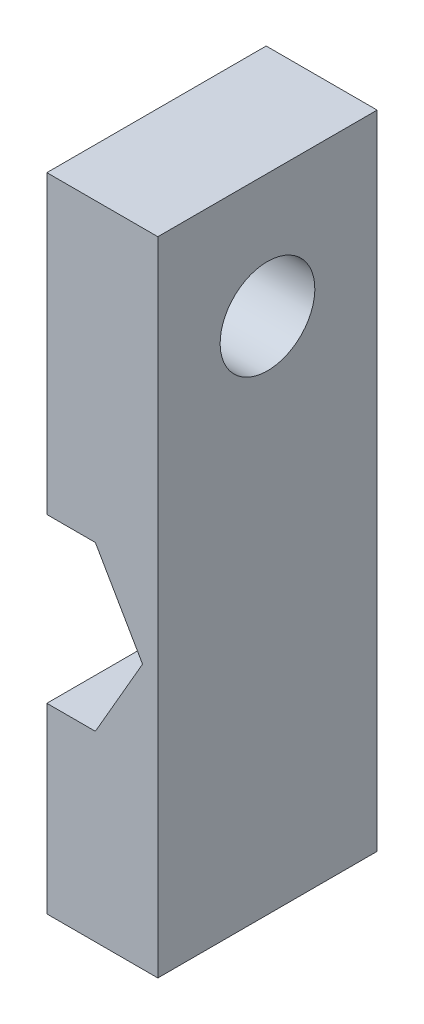
ISO-10303-21;
HEADER;
FILE_DESCRIPTION(('STEP AP214'),'2;1');
FILE_NAME('part.step','',(''),(''),'','','');
FILE_SCHEMA(('AUTOMOTIVE_DESIGN { 1 0 10303 214 1 1 1 1 }'));
ENDSEC;
DATA;
#1=APPLICATION_CONTEXT('core data for automotive mechanical design processes');
#2=APPLICATION_PROTOCOL_DEFINITION('international standard','automotive_design',2000,#1);
#3=PRODUCT_CONTEXT('',#1,'mechanical');
#4=PRODUCT('Part','Part','',(#3));
#5=PRODUCT_RELATED_PRODUCT_CATEGORY('part','',(#4));
#6=PRODUCT_DEFINITION_FORMATION('','',#4);
#7=PRODUCT_DEFINITION_CONTEXT('part definition',#1,'design');
#8=PRODUCT_DEFINITION('design','',#6,#7);
#9=PRODUCT_DEFINITION_SHAPE('','',#8);
#10=(LENGTH_UNIT() NAMED_UNIT(*) SI_UNIT(.MILLI.,.METRE.));
#11=(NAMED_UNIT(*) PLANE_ANGLE_UNIT() SI_UNIT($,.RADIAN.));
#12=(NAMED_UNIT(*) SI_UNIT($,.STERADIAN.) SOLID_ANGLE_UNIT());
#13=UNCERTAINTY_MEASURE_WITH_UNIT(LENGTH_MEASURE(1.E-05),#10,'distance_accuracy_value','');
#14=(GEOMETRIC_REPRESENTATION_CONTEXT(3) GLOBAL_UNCERTAINTY_ASSIGNED_CONTEXT((#13)) GLOBAL_UNIT_ASSIGNED_CONTEXT((#10,
#11,#12)) REPRESENTATION_CONTEXT('',''));
#15=CARTESIAN_POINT('',(0.,0.,0.));
#16=DIRECTION('',(0.,0.,1.));
#17=DIRECTION('',(1.,0.,0.));
#18=AXIS2_PLACEMENT_3D('',#15,#16,#17);
#19=CARTESIAN_POINT('',(0.,0.,22.));
#20=DIRECTION('',(0.,0.,1.));
#21=DIRECTION('',(1.,0.,0.));
#22=AXIS2_PLACEMENT_3D('',#19,#20,#21);
#23=PLANE('',#22);
#24=DIRECTION('',(-1.,0.,0.));
#25=VECTOR('',#24,1.);
#26=CARTESIAN_POINT('',(-10.8674698795181,4.62068534094692,22.));
#27=LINE('',#26,#25);
#28=CARTESIAN_POINT('',(11.1325301204819,4.62068534094692,22.));
#29=VERTEX_POINT('',#28);
#30=CARTESIAN_POINT('',(0.,4.62068534094692,22.));
#31=VERTEX_POINT('',#30);
#32=EDGE_CURVE('E148',#29,#31,#27,.T.);
#33=ORIENTED_EDGE('',*,*,#32,.T.);
#34=DIRECTION('',(0.,-1.,0.));
#35=VECTOR('',#34,1.);
#36=CARTESIAN_POINT('',(0.,4.62068534094692,22.));
#37=LINE('',#36,#35);
#38=CARTESIAN_POINT('',(0.,-25.0793146590531,22.));
#39=VERTEX_POINT('',#38);
#40=EDGE_CURVE('E113',#31,#39,#37,.T.);
#41=ORIENTED_EDGE('',*,*,#40,.T.);
#42=DIRECTION('',(-1.,0.,0.));
#43=VECTOR('',#42,1.);
#44=CARTESIAN_POINT('',(4.86680232783685,-25.0793146590531,22.));
#45=LINE('',#44,#43);
#46=CARTESIAN_POINT('',(4.86680232783685,-25.0793146590531,22.));
#47=VERTEX_POINT('',#46);
#48=EDGE_CURVE('E191',#47,#39,#45,.T.);
#49=ORIENTED_EDGE('',*,*,#48,.F.);
#50=DIRECTION('',(-0.5,0.866025403784438,0.));
#51=VECTOR('',#50,1.);
#52=CARTESIAN_POINT('',(9.60107453519178,-33.2793146590531,22.));
#53=LINE('',#52,#51);
#54=CARTESIAN_POINT('',(9.60107453519178,-33.2793146590531,22.));
#55=VERTEX_POINT('',#54);
#56=EDGE_CURVE('E195',#55,#47,#53,.T.);
#57=ORIENTED_EDGE('',*,*,#56,.F.);
#58=DIRECTION('',(0.499999999999999,0.866025403784439,0.));
#59=VECTOR('',#58,1.);
#60=CARTESIAN_POINT('',(4.86680232783685,-41.4793146590531,22.));
#61=LINE('',#60,#59);
#62=CARTESIAN_POINT('',(4.86680232783685,-41.4793146590531,22.));
#63=VERTEX_POINT('',#62);
#64=EDGE_CURVE('E179',#63,#55,#61,.T.);
#65=ORIENTED_EDGE('',*,*,#64,.F.);
#66=DIRECTION('',(1.,0.,0.));
#67=VECTOR('',#66,1.);
#68=CARTESIAN_POINT('',(-4.60174208687301,-41.4793146590531,22.));
#69=LINE('',#68,#67);
#70=CARTESIAN_POINT('',(0.,-41.4793146590531,22.));
#71=VERTEX_POINT('',#70);
#72=EDGE_CURVE('E175',#71,#63,#69,.T.);
#73=ORIENTED_EDGE('',*,*,#72,.F.);
#74=CARTESIAN_POINT('',(0.,-59.7793146590531,22.));
#75=VERTEX_POINT('',#74);
#76=EDGE_CURVE('E64',#71,#75,#37,.T.);
#77=ORIENTED_EDGE('',*,*,#76,.T.);
#78=DIRECTION('',(1.,0.,0.));
#79=VECTOR('',#78,1.);
#80=CARTESIAN_POINT('',(-10.8674698795181,-59.7793146590531,22.));
#81=LINE('',#80,#79);
#82=CARTESIAN_POINT('',(11.1325301204819,-59.7793146590531,22.));
#83=VERTEX_POINT('',#82);
#84=EDGE_CURVE('E136',#75,#83,#81,.T.);
#85=ORIENTED_EDGE('',*,*,#84,.T.);
#86=DIRECTION('',(0.,1.,0.));
#87=VECTOR('',#86,1.);
#88=CARTESIAN_POINT('',(11.1325301204819,4.62068534094692,22.));
#89=LINE('',#88,#87);
#90=EDGE_CURVE('E141',#83,#29,#89,.T.);
#91=ORIENTED_EDGE('',*,*,#90,.T.);
#92=EDGE_LOOP('',(#33,#41,#49,#57,#65,#73,#77,#85,#91));
#93=FACE_BOUND('',#92,.T.);
#94=ADVANCED_FACE('F39',(#93),#23,.T.);
#95=CARTESIAN_POINT('',(0.,0.,0.));
#96=DIRECTION('',(0.,0.,1.));
#97=DIRECTION('',(1.,0.,0.));
#98=AXIS2_PLACEMENT_3D('',#95,#96,#97);
#99=PLANE('',#98);
#100=DIRECTION('',(0.,1.,0.));
#101=VECTOR('',#100,1.);
#102=CARTESIAN_POINT('',(0.,4.62068534094692,0.));
#103=LINE('',#102,#101);
#104=CARTESIAN_POINT('',(0.,-25.0793146590531,0.));
#105=VERTEX_POINT('',#104);
#106=CARTESIAN_POINT('',(0.,4.62068534094692,0.));
#107=VERTEX_POINT('',#106);
#108=EDGE_CURVE('E56',#105,#107,#103,.T.);
#109=ORIENTED_EDGE('',*,*,#108,.T.);
#110=DIRECTION('',(-1.,0.,0.));
#111=VECTOR('',#110,1.);
#112=CARTESIAN_POINT('',(-10.8674698795181,4.62068534094692,0.));
#113=LINE('',#112,#111);
#114=CARTESIAN_POINT('',(11.1325301204819,4.62068534094692,0.));
#115=VERTEX_POINT('',#114);
#116=EDGE_CURVE('E126',#115,#107,#113,.T.);
#117=ORIENTED_EDGE('',*,*,#116,.F.);
#118=DIRECTION('',(0.,1.,0.));
#119=VECTOR('',#118,1.);
#120=CARTESIAN_POINT('',(11.1325301204819,4.62068534094692,0.));
#121=LINE('',#120,#119);
#122=CARTESIAN_POINT('',(11.1325301204819,-59.7793146590531,0.));
#123=VERTEX_POINT('',#122);
#124=EDGE_CURVE('E137',#123,#115,#121,.T.);
#125=ORIENTED_EDGE('',*,*,#124,.F.);
#126=DIRECTION('',(1.,0.,0.));
#127=VECTOR('',#126,1.);
#128=CARTESIAN_POINT('',(-10.8674698795181,-59.7793146590531,0.));
#129=LINE('',#128,#127);
#130=CARTESIAN_POINT('',(0.,-59.7793146590531,0.));
#131=VERTEX_POINT('',#130);
#132=EDGE_CURVE('E143',#131,#123,#129,.T.);
#133=ORIENTED_EDGE('',*,*,#132,.F.);
#134=CARTESIAN_POINT('',(0.,-41.4793146590531,0.));
#135=VERTEX_POINT('',#134);
#136=EDGE_CURVE('E119',#131,#135,#103,.T.);
#137=ORIENTED_EDGE('',*,*,#136,.T.);
#138=DIRECTION('',(1.,0.,0.));
#139=VECTOR('',#138,1.);
#140=CARTESIAN_POINT('',(-4.60174208687301,-41.4793146590531,0.));
#141=LINE('',#140,#139);
#142=CARTESIAN_POINT('',(4.86680232783685,-41.4793146590531,0.));
#143=VERTEX_POINT('',#142);
#144=EDGE_CURVE('E176',#135,#143,#141,.T.);
#145=ORIENTED_EDGE('',*,*,#144,.T.);
#146=DIRECTION('',(0.499999999999999,0.866025403784439,0.));
#147=VECTOR('',#146,1.);
#148=CARTESIAN_POINT('',(4.86680232783685,-41.4793146590531,0.));
#149=LINE('',#148,#147);
#150=CARTESIAN_POINT('',(9.60107453519178,-33.2793146590531,0.));
#151=VERTEX_POINT('',#150);
#152=EDGE_CURVE('E185',#143,#151,#149,.T.);
#153=ORIENTED_EDGE('',*,*,#152,.T.);
#154=DIRECTION('',(-0.5,0.866025403784438,0.));
#155=VECTOR('',#154,1.);
#156=CARTESIAN_POINT('',(9.60107453519178,-33.2793146590531,0.));
#157=LINE('',#156,#155);
#158=CARTESIAN_POINT('',(4.86680232783685,-25.0793146590531,0.));
#159=VERTEX_POINT('',#158);
#160=EDGE_CURVE('E182',#151,#159,#157,.T.);
#161=ORIENTED_EDGE('',*,*,#160,.T.);
#162=DIRECTION('',(-1.,0.,0.));
#163=VECTOR('',#162,1.);
#164=CARTESIAN_POINT('',(4.86680232783685,-25.0793146590531,0.));
#165=LINE('',#164,#163);
#166=EDGE_CURVE('E129',#159,#105,#165,.T.);
#167=ORIENTED_EDGE('',*,*,#166,.T.);
#168=EDGE_LOOP('',(#109,#117,#125,#133,#137,#145,#153,#161,#167));
#169=FACE_BOUND('',#168,.T.);
#170=ADVANCED_FACE('F124',(#169),#99,.F.);
#171=CARTESIAN_POINT('',(-10.8674698795181,-59.7793146590531,22.));
#172=DIRECTION('',(0.,1.,0.));
#173=DIRECTION('',(0.,0.,1.));
#174=AXIS2_PLACEMENT_3D('',#171,#172,#173);
#175=PLANE('',#174);
#176=DIRECTION('',(0.,0.,-1.));
#177=VECTOR('',#176,1.);
#178=CARTESIAN_POINT('',(0.,-59.7793146590531,0.));
#179=LINE('',#178,#177);
#180=EDGE_CURVE('E209',#75,#131,#179,.T.);
#181=ORIENTED_EDGE('',*,*,#180,.T.);
#182=ORIENTED_EDGE('',*,*,#132,.T.);
#183=DIRECTION('',(0.,0.,-1.));
#184=VECTOR('',#183,1.);
#185=CARTESIAN_POINT('',(11.1325301204819,-59.7793146590531,22.));
#186=LINE('',#185,#184);
#187=EDGE_CURVE('E11',#83,#123,#186,.T.);
#188=ORIENTED_EDGE('',*,*,#187,.F.);
#189=ORIENTED_EDGE('',*,*,#84,.F.);
#190=EDGE_LOOP('',(#181,#182,#188,#189));
#191=FACE_BOUND('',#190,.T.);
#192=ADVANCED_FACE('F41',(#191),#175,.F.);
#193=CARTESIAN_POINT('',(-10.8674698795181,4.62068534094692,22.));
#194=DIRECTION('',(0.,-1.,0.));
#195=DIRECTION('',(1.,0.,0.));
#196=AXIS2_PLACEMENT_3D('',#193,#194,#195);
#197=PLANE('',#196);
#198=DIRECTION('',(0.,0.,1.));
#199=VECTOR('',#198,1.);
#200=CARTESIAN_POINT('',(0.,4.62068534094692,0.));
#201=LINE('',#200,#199);
#202=EDGE_CURVE('E110',#107,#31,#201,.T.);
#203=ORIENTED_EDGE('',*,*,#202,.T.);
#204=ORIENTED_EDGE('',*,*,#32,.F.);
#205=DIRECTION('',(0.,0.,-1.));
#206=VECTOR('',#205,1.);
#207=CARTESIAN_POINT('',(11.1325301204819,4.62068534094692,22.));
#208=LINE('',#207,#206);
#209=EDGE_CURVE('E49',#29,#115,#208,.T.);
#210=ORIENTED_EDGE('',*,*,#209,.T.);
#211=ORIENTED_EDGE('',*,*,#116,.T.);
#212=EDGE_LOOP('',(#203,#204,#210,#211));
#213=FACE_BOUND('',#212,.T.);
#214=ADVANCED_FACE('F133',(#213),#197,.F.);
#215=CARTESIAN_POINT('',(4.86680232783685,-25.0793146590531,22.));
#216=DIRECTION('',(0.,-1.,0.));
#217=DIRECTION('',(1.,0.,0.));
#218=AXIS2_PLACEMENT_3D('',#215,#216,#217);
#219=PLANE('',#218);
#220=ORIENTED_EDGE('',*,*,#48,.T.);
#221=DIRECTION('',(0.,0.,-1.));
#222=VECTOR('',#221,1.);
#223=CARTESIAN_POINT('',(0.,-25.0793146590531,22.));
#224=LINE('',#223,#222);
#225=EDGE_CURVE('E203',#39,#105,#224,.T.);
#226=ORIENTED_EDGE('',*,*,#225,.T.);
#227=ORIENTED_EDGE('',*,*,#166,.F.);
#228=DIRECTION('',(0.,0.,-1.));
#229=VECTOR('',#228,1.);
#230=CARTESIAN_POINT('',(4.86680232783685,-25.0793146590531,22.));
#231=LINE('',#230,#229);
#232=EDGE_CURVE('E162',#47,#159,#231,.T.);
#233=ORIENTED_EDGE('',*,*,#232,.F.);
#234=EDGE_LOOP('',(#220,#226,#227,#233));
#235=FACE_BOUND('',#234,.T.);
#236=ADVANCED_FACE('F228',(#235),#219,.T.);
#237=CARTESIAN_POINT('',(-4.60174208687301,-41.4793146590531,22.));
#238=DIRECTION('',(0.,1.,0.));
#239=DIRECTION('',(0.,0.,1.));
#240=AXIS2_PLACEMENT_3D('',#237,#238,#239);
#241=PLANE('',#240);
#242=ORIENTED_EDGE('',*,*,#144,.F.);
#243=DIRECTION('',(0.,0.,1.));
#244=VECTOR('',#243,1.);
#245=CARTESIAN_POINT('',(0.,-41.4793146590531,22.));
#246=LINE('',#245,#244);
#247=EDGE_CURVE('E206',#135,#71,#246,.T.);
#248=ORIENTED_EDGE('',*,*,#247,.T.);
#249=ORIENTED_EDGE('',*,*,#72,.T.);
#250=DIRECTION('',(0.,0.,-1.));
#251=VECTOR('',#250,1.);
#252=CARTESIAN_POINT('',(4.86680232783685,-41.4793146590531,22.));
#253=LINE('',#252,#251);
#254=EDGE_CURVE('E169',#63,#143,#253,.T.);
#255=ORIENTED_EDGE('',*,*,#254,.T.);
#256=EDGE_LOOP('',(#242,#248,#249,#255));
#257=FACE_BOUND('',#256,.T.);
#258=ADVANCED_FACE('F217',(#257),#241,.T.);
#259=CARTESIAN_POINT('',(-10.8674698795181,-7.77931465905308,11.));
#260=DIRECTION('',(1.,0.,0.));
#261=DIRECTION('',(0.,1.,0.));
#262=AXIS2_PLACEMENT_3D('',#259,#260,#261);
#263=CYLINDRICAL_SURFACE('',#262,4.75);
#264=CARTESIAN_POINT('',(11.1325301204819,-7.77931465905308,11.));
#265=DIRECTION('',(1.,0.,0.));
#266=DIRECTION('',(0.,1.,0.));
#267=AXIS2_PLACEMENT_3D('',#264,#265,#266);
#268=CIRCLE('',#267,4.75);
#269=CARTESIAN_POINT('',(11.1325301204819,-3.02931465905308,11.));
#270=VERTEX_POINT('',#269);
#271=EDGE_CURVE('E188',#270,#270,#268,.T.);
#272=ORIENTED_EDGE('',*,*,#271,.T.);
#273=EDGE_LOOP('',(#272));
#274=FACE_BOUND('',#273,.T.);
#275=CARTESIAN_POINT('',(0.,-7.77931465905308,11.));
#276=DIRECTION('',(-1.,0.,0.));
#277=DIRECTION('',(0.,0.,1.));
#278=AXIS2_PLACEMENT_3D('',#275,#276,#277);
#279=CIRCLE('',#278,4.75);
#280=CARTESIAN_POINT('',(0.,-7.77931465905308,15.75));
#281=VERTEX_POINT('',#280);
#282=EDGE_CURVE('E43',#281,#281,#279,.F.);
#283=ORIENTED_EDGE('',*,*,#282,.F.);
#284=EDGE_LOOP('',(#283));
#285=FACE_BOUND('',#284,.T.);
#286=ADVANCED_FACE('F235',(#274,#285),#263,.F.);
#287=CARTESIAN_POINT('',(11.1325301204819,4.62068534094692,22.));
#288=DIRECTION('',(-1.,0.,0.));
#289=DIRECTION('',(0.,-1.,0.));
#290=AXIS2_PLACEMENT_3D('',#287,#288,#289);
#291=PLANE('',#290);
#292=ORIENTED_EDGE('',*,*,#271,.F.);
#293=EDGE_LOOP('',(#292));
#294=FACE_BOUND('',#293,.T.);
#295=ORIENTED_EDGE('',*,*,#124,.T.);
#296=ORIENTED_EDGE('',*,*,#209,.F.);
#297=ORIENTED_EDGE('',*,*,#90,.F.);
#298=ORIENTED_EDGE('',*,*,#187,.T.);
#299=EDGE_LOOP('',(#295,#296,#297,#298));
#300=FACE_BOUND('',#299,.T.);
#301=ADVANCED_FACE('F246',(#294,#300),#291,.F.);
#302=CARTESIAN_POINT('',(4.86680232783685,-41.4793146590531,22.));
#303=DIRECTION('',(-0.866025403784439,0.5,0.));
#304=DIRECTION('',(-0.5,-0.866025403784439,0.));
#305=AXIS2_PLACEMENT_3D('',#302,#303,#304);
#306=PLANE('',#305);
#307=ORIENTED_EDGE('',*,*,#152,.F.);
#308=ORIENTED_EDGE('',*,*,#254,.F.);
#309=ORIENTED_EDGE('',*,*,#64,.T.);
#310=DIRECTION('',(0.,0.,-1.));
#311=VECTOR('',#310,1.);
#312=CARTESIAN_POINT('',(9.60107453519178,-33.2793146590531,22.));
#313=LINE('',#312,#311);
#314=EDGE_CURVE('E155',#55,#151,#313,.T.);
#315=ORIENTED_EDGE('',*,*,#314,.T.);
#316=EDGE_LOOP('',(#307,#308,#309,#315));
#317=FACE_BOUND('',#316,.T.);
#318=ADVANCED_FACE('F221',(#317),#306,.T.);
#319=CARTESIAN_POINT('',(9.60107453519178,-33.2793146590531,22.));
#320=DIRECTION('',(-0.866025403784439,-0.5,0.));
#321=DIRECTION('',(0.5,-0.866025403784439,0.));
#322=AXIS2_PLACEMENT_3D('',#319,#320,#321);
#323=PLANE('',#322);
#324=ORIENTED_EDGE('',*,*,#160,.F.);
#325=ORIENTED_EDGE('',*,*,#314,.F.);
#326=ORIENTED_EDGE('',*,*,#56,.T.);
#327=ORIENTED_EDGE('',*,*,#232,.T.);
#328=EDGE_LOOP('',(#324,#325,#326,#327));
#329=FACE_BOUND('',#328,.T.);
#330=ADVANCED_FACE('F226',(#329),#323,.T.);
#331=CARTESIAN_POINT('',(0.,0.,0.));
#332=DIRECTION('',(-1.,0.,0.));
#333=DIRECTION('',(0.,0.,1.));
#334=AXIS2_PLACEMENT_3D('',#331,#332,#333);
#335=PLANE('',#334);
#336=ORIENTED_EDGE('',*,*,#282,.T.);
#337=EDGE_LOOP('',(#336));
#338=FACE_BOUND('',#337,.T.);
#339=ORIENTED_EDGE('',*,*,#40,.F.);
#340=ORIENTED_EDGE('',*,*,#202,.F.);
#341=ORIENTED_EDGE('',*,*,#108,.F.);
#342=ORIENTED_EDGE('',*,*,#225,.F.);
#343=EDGE_LOOP('',(#339,#340,#341,#342));
#344=FACE_BOUND('',#343,.T.);
#345=ADVANCED_FACE('F111',(#338,#344),#335,.T.);
#346=ORIENTED_EDGE('',*,*,#136,.F.);
#347=ORIENTED_EDGE('',*,*,#180,.F.);
#348=ORIENTED_EDGE('',*,*,#76,.F.);
#349=ORIENTED_EDGE('',*,*,#247,.F.);
#350=EDGE_LOOP('',(#346,#347,#348,#349));
#351=FACE_BOUND('',#350,.T.);
#352=ADVANCED_FACE('F266',(#351),#335,.T.);
#353=CLOSED_SHELL('',(#94,#170,#192,#214,#236,#258,#286,#301,#318,#330,#345,#352));
#354=MANIFOLD_SOLID_BREP('B2',#353);
#355=ADVANCED_BREP_SHAPE_REPRESENTATION('',(#18,#354),#14);
#356=SHAPE_DEFINITION_REPRESENTATION(#9,#355);
ENDSEC;
END-ISO-10303-21;
